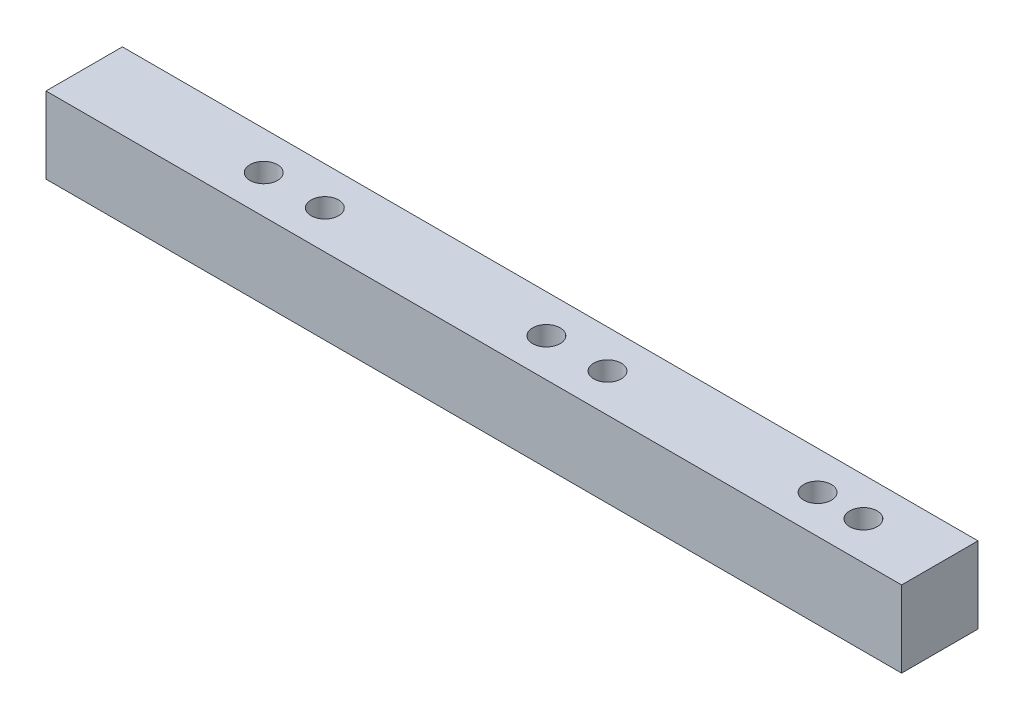
ISO-10303-21;
HEADER;
FILE_DESCRIPTION(('STEP AP214'),'2;1');
FILE_NAME('part.step','',(''),(''),'','','');
FILE_SCHEMA(('AUTOMOTIVE_DESIGN { 1 0 10303 214 1 1 1 1 }'));
ENDSEC;
DATA;
#1=APPLICATION_CONTEXT('core data for automotive mechanical design processes');
#2=APPLICATION_PROTOCOL_DEFINITION('international standard','automotive_design',2000,#1);
#3=PRODUCT_CONTEXT('',#1,'mechanical');
#4=PRODUCT('Part','Part','',(#3));
#5=PRODUCT_RELATED_PRODUCT_CATEGORY('part','',(#4));
#6=PRODUCT_DEFINITION_FORMATION('','',#4);
#7=PRODUCT_DEFINITION_CONTEXT('part definition',#1,'design');
#8=PRODUCT_DEFINITION('design','',#6,#7);
#9=PRODUCT_DEFINITION_SHAPE('','',#8);
#10=(LENGTH_UNIT() NAMED_UNIT(*) SI_UNIT(.MILLI.,.METRE.));
#11=(NAMED_UNIT(*) PLANE_ANGLE_UNIT() SI_UNIT($,.RADIAN.));
#12=(NAMED_UNIT(*) SI_UNIT($,.STERADIAN.) SOLID_ANGLE_UNIT());
#13=UNCERTAINTY_MEASURE_WITH_UNIT(LENGTH_MEASURE(1.E-05),#10,'distance_accuracy_value','');
#14=(GEOMETRIC_REPRESENTATION_CONTEXT(3) GLOBAL_UNCERTAINTY_ASSIGNED_CONTEXT((#13)) GLOBAL_UNIT_ASSIGNED_CONTEXT((#10,
#11,#12)) REPRESENTATION_CONTEXT('',''));
#15=CARTESIAN_POINT('',(0.,0.,0.));
#16=DIRECTION('',(0.,0.,1.));
#17=DIRECTION('',(1.,0.,0.));
#18=AXIS2_PLACEMENT_3D('',#15,#16,#17);
#19=CARTESIAN_POINT('',(-35.56,0.,6.35));
#20=DIRECTION('',(1.,0.,0.));
#21=DIRECTION('',(0.,0.,-1.));
#22=AXIS2_PLACEMENT_3D('',#19,#20,#21);
#23=PLANE('',#22);
#24=DIRECTION('',(0.,-1.,0.));
#25=VECTOR('',#24,1.);
#26=CARTESIAN_POINT('',(-35.56,0.,0.));
#27=LINE('',#26,#25);
#28=CARTESIAN_POINT('',(-35.56,6.35,0.));
#29=VERTEX_POINT('',#28);
#30=CARTESIAN_POINT('',(-35.56,0.,0.));
#31=VERTEX_POINT('',#30);
#32=EDGE_CURVE('E107',#29,#31,#27,.T.);
#33=ORIENTED_EDGE('',*,*,#32,.T.);
#34=DIRECTION('',(0.,0.,-1.));
#35=VECTOR('',#34,1.);
#36=CARTESIAN_POINT('',(-35.56,0.,6.35));
#37=LINE('',#36,#35);
#38=CARTESIAN_POINT('',(-35.56,0.,6.35));
#39=VERTEX_POINT('',#38);
#40=EDGE_CURVE('E11',#39,#31,#37,.T.);
#41=ORIENTED_EDGE('',*,*,#40,.F.);
#42=DIRECTION('',(0.,-1.,0.));
#43=VECTOR('',#42,1.);
#44=CARTESIAN_POINT('',(-35.56,0.,6.35));
#45=LINE('',#44,#43);
#46=CARTESIAN_POINT('',(-35.56,6.35,6.35));
#47=VERTEX_POINT('',#46);
#48=EDGE_CURVE('E91',#47,#39,#45,.T.);
#49=ORIENTED_EDGE('',*,*,#48,.F.);
#50=DIRECTION('',(0.,0.,-1.));
#51=VECTOR('',#50,1.);
#52=CARTESIAN_POINT('',(-35.56,6.35,6.35));
#53=LINE('',#52,#51);
#54=EDGE_CURVE('E103',#47,#29,#53,.T.);
#55=ORIENTED_EDGE('',*,*,#54,.T.);
#56=EDGE_LOOP('',(#33,#41,#49,#55));
#57=FACE_BOUND('',#56,.T.);
#58=ADVANCED_FACE('F39',(#57),#23,.F.);
#59=CARTESIAN_POINT('',(-35.56,0.,6.35));
#60=DIRECTION('',(0.,1.,0.));
#61=DIRECTION('',(0.,0.,1.));
#62=AXIS2_PLACEMENT_3D('',#59,#60,#61);
#63=PLANE('',#62);
#64=CARTESIAN_POINT('',(-20.6375,0.,3.175));
#65=DIRECTION('',(0.,1.,0.));
#66=DIRECTION('',(0.,0.,1.));
#67=AXIS2_PLACEMENT_3D('',#64,#65,#66);
#68=CIRCLE('',#67,1.143);
#69=CARTESIAN_POINT('',(-20.6375,0.,4.318));
#70=VERTEX_POINT('',#69);
#71=EDGE_CURVE('E168',#70,#70,#68,.T.);
#72=ORIENTED_EDGE('',*,*,#71,.T.);
#73=EDGE_LOOP('',(#72));
#74=FACE_BOUND('',#73,.T.);
#75=CARTESIAN_POINT('',(-15.5575,0.,3.175));
#76=DIRECTION('',(0.,1.,0.));
#77=DIRECTION('',(0.,0.,1.));
#78=AXIS2_PLACEMENT_3D('',#75,#76,#77);
#79=CIRCLE('',#78,1.143);
#80=CARTESIAN_POINT('',(-15.5575,0.,4.318));
#81=VERTEX_POINT('',#80);
#82=EDGE_CURVE('E160',#81,#81,#79,.T.);
#83=ORIENTED_EDGE('',*,*,#82,.T.);
#84=EDGE_LOOP('',(#83));
#85=FACE_BOUND('',#84,.T.);
#86=CARTESIAN_POINT('',(2.8575,0.,3.175));
#87=DIRECTION('',(0.,1.,0.));
#88=DIRECTION('',(0.,0.,1.));
#89=AXIS2_PLACEMENT_3D('',#86,#87,#88);
#90=CIRCLE('',#89,1.143);
#91=CARTESIAN_POINT('',(2.8575,0.,4.318));
#92=VERTEX_POINT('',#91);
#93=EDGE_CURVE('E152',#92,#92,#90,.T.);
#94=ORIENTED_EDGE('',*,*,#93,.T.);
#95=EDGE_LOOP('',(#94));
#96=FACE_BOUND('',#95,.T.);
#97=CARTESIAN_POINT('',(7.9375,0.,3.175));
#98=DIRECTION('',(0.,1.,0.));
#99=DIRECTION('',(0.,0.,1.));
#100=AXIS2_PLACEMENT_3D('',#97,#98,#99);
#101=CIRCLE('',#100,1.143);
#102=CARTESIAN_POINT('',(7.9375,0.,4.318));
#103=VERTEX_POINT('',#102);
#104=EDGE_CURVE('E144',#103,#103,#101,.T.);
#105=ORIENTED_EDGE('',*,*,#104,.T.);
#106=EDGE_LOOP('',(#105));
#107=FACE_BOUND('',#106,.T.);
#108=CARTESIAN_POINT('',(25.4,0.,3.175));
#109=DIRECTION('',(0.,1.,0.));
#110=DIRECTION('',(0.,0.,1.));
#111=AXIS2_PLACEMENT_3D('',#108,#109,#110);
#112=CIRCLE('',#111,1.143);
#113=CARTESIAN_POINT('',(25.4,0.,4.318));
#114=VERTEX_POINT('',#113);
#115=EDGE_CURVE('E136',#114,#114,#112,.T.);
#116=ORIENTED_EDGE('',*,*,#115,.T.);
#117=EDGE_LOOP('',(#116));
#118=FACE_BOUND('',#117,.T.);
#119=CARTESIAN_POINT('',(29.21,0.,3.175));
#120=DIRECTION('',(0.,1.,0.));
#121=DIRECTION('',(0.,0.,1.));
#122=AXIS2_PLACEMENT_3D('',#119,#120,#121);
#123=CIRCLE('',#122,1.143);
#124=CARTESIAN_POINT('',(29.21,0.,4.318));
#125=VERTEX_POINT('',#124);
#126=EDGE_CURVE('E128',#125,#125,#123,.T.);
#127=ORIENTED_EDGE('',*,*,#126,.T.);
#128=EDGE_LOOP('',(#127));
#129=FACE_BOUND('',#128,.T.);
#130=DIRECTION('',(1.,0.,0.));
#131=VECTOR('',#130,1.);
#132=CARTESIAN_POINT('',(-35.56,0.,0.));
#133=LINE('',#132,#131);
#134=CARTESIAN_POINT('',(35.56,0.,0.));
#135=VERTEX_POINT('',#134);
#136=EDGE_CURVE('E96',#31,#135,#133,.T.);
#137=ORIENTED_EDGE('',*,*,#136,.T.);
#138=DIRECTION('',(0.,0.,-1.));
#139=VECTOR('',#138,1.);
#140=CARTESIAN_POINT('',(35.56,0.,6.35));
#141=LINE('',#140,#139);
#142=CARTESIAN_POINT('',(35.56,0.,6.35));
#143=VERTEX_POINT('',#142);
#144=EDGE_CURVE('E48',#143,#135,#141,.T.);
#145=ORIENTED_EDGE('',*,*,#144,.F.);
#146=DIRECTION('',(1.,0.,0.));
#147=VECTOR('',#146,1.);
#148=CARTESIAN_POINT('',(-35.56,0.,6.35));
#149=LINE('',#148,#147);
#150=EDGE_CURVE('E86',#39,#143,#149,.T.);
#151=ORIENTED_EDGE('',*,*,#150,.F.);
#152=ORIENTED_EDGE('',*,*,#40,.T.);
#153=EDGE_LOOP('',(#137,#145,#151,#152));
#154=FACE_BOUND('',#153,.T.);
#155=ADVANCED_FACE('F95',(#74,#85,#96,#107,#118,#129,#154),#63,.F.);
#156=CARTESIAN_POINT('',(35.56,0.,6.35));
#157=DIRECTION('',(-1.,0.,0.));
#158=DIRECTION('',(0.,0.,1.));
#159=AXIS2_PLACEMENT_3D('',#156,#157,#158);
#160=PLANE('',#159);
#161=DIRECTION('',(0.,1.,0.));
#162=VECTOR('',#161,1.);
#163=CARTESIAN_POINT('',(35.56,0.,0.));
#164=LINE('',#163,#162);
#165=CARTESIAN_POINT('',(35.56,6.35,0.));
#166=VERTEX_POINT('',#165);
#167=EDGE_CURVE('E73',#135,#166,#164,.T.);
#168=ORIENTED_EDGE('',*,*,#167,.T.);
#169=DIRECTION('',(0.,0.,-1.));
#170=VECTOR('',#169,1.);
#171=CARTESIAN_POINT('',(35.56,6.35,6.35));
#172=LINE('',#171,#170);
#173=CARTESIAN_POINT('',(35.56,6.35,6.35));
#174=VERTEX_POINT('',#173);
#175=EDGE_CURVE('E98',#174,#166,#172,.T.);
#176=ORIENTED_EDGE('',*,*,#175,.F.);
#177=DIRECTION('',(0.,1.,0.));
#178=VECTOR('',#177,1.);
#179=CARTESIAN_POINT('',(35.56,0.,6.35));
#180=LINE('',#179,#178);
#181=EDGE_CURVE('E89',#143,#174,#180,.T.);
#182=ORIENTED_EDGE('',*,*,#181,.F.);
#183=ORIENTED_EDGE('',*,*,#144,.T.);
#184=EDGE_LOOP('',(#168,#176,#182,#183));
#185=FACE_BOUND('',#184,.T.);
#186=ADVANCED_FACE('F99',(#185),#160,.F.);
#187=CARTESIAN_POINT('',(-35.56,6.35,6.35));
#188=DIRECTION('',(0.,-1.,0.));
#189=DIRECTION('',(0.,0.,-1.));
#190=AXIS2_PLACEMENT_3D('',#187,#188,#189);
#191=PLANE('',#190);
#192=CARTESIAN_POINT('',(-20.6375,6.35,3.175));
#193=DIRECTION('',(0.,1.,0.));
#194=DIRECTION('',(0.,0.,1.));
#195=AXIS2_PLACEMENT_3D('',#192,#193,#194);
#196=CIRCLE('',#195,1.143);
#197=CARTESIAN_POINT('',(-20.6375,6.35,4.318));
#198=VERTEX_POINT('',#197);
#199=EDGE_CURVE('E111',#198,#198,#196,.T.);
#200=ORIENTED_EDGE('',*,*,#199,.F.);
#201=EDGE_LOOP('',(#200));
#202=FACE_BOUND('',#201,.T.);
#203=CARTESIAN_POINT('',(-15.5575,6.35,3.175));
#204=DIRECTION('',(0.,1.,0.));
#205=DIRECTION('',(0.,0.,1.));
#206=AXIS2_PLACEMENT_3D('',#203,#204,#205);
#207=CIRCLE('',#206,1.143);
#208=CARTESIAN_POINT('',(-15.5575,6.35,4.318));
#209=VERTEX_POINT('',#208);
#210=EDGE_CURVE('E164',#209,#209,#207,.T.);
#211=ORIENTED_EDGE('',*,*,#210,.F.);
#212=EDGE_LOOP('',(#211));
#213=FACE_BOUND('',#212,.T.);
#214=CARTESIAN_POINT('',(2.8575,6.35,3.175));
#215=DIRECTION('',(0.,1.,0.));
#216=DIRECTION('',(0.,0.,1.));
#217=AXIS2_PLACEMENT_3D('',#214,#215,#216);
#218=CIRCLE('',#217,1.143);
#219=CARTESIAN_POINT('',(2.8575,6.35,4.318));
#220=VERTEX_POINT('',#219);
#221=EDGE_CURVE('E156',#220,#220,#218,.T.);
#222=ORIENTED_EDGE('',*,*,#221,.F.);
#223=EDGE_LOOP('',(#222));
#224=FACE_BOUND('',#223,.T.);
#225=CARTESIAN_POINT('',(7.9375,6.35,3.175));
#226=DIRECTION('',(0.,1.,0.));
#227=DIRECTION('',(0.,0.,1.));
#228=AXIS2_PLACEMENT_3D('',#225,#226,#227);
#229=CIRCLE('',#228,1.143);
#230=CARTESIAN_POINT('',(7.9375,6.35,4.318));
#231=VERTEX_POINT('',#230);
#232=EDGE_CURVE('E148',#231,#231,#229,.T.);
#233=ORIENTED_EDGE('',*,*,#232,.F.);
#234=EDGE_LOOP('',(#233));
#235=FACE_BOUND('',#234,.T.);
#236=CARTESIAN_POINT('',(25.4,6.35,3.175));
#237=DIRECTION('',(0.,1.,0.));
#238=DIRECTION('',(0.,0.,1.));
#239=AXIS2_PLACEMENT_3D('',#236,#237,#238);
#240=CIRCLE('',#239,1.143);
#241=CARTESIAN_POINT('',(25.4,6.35,4.318));
#242=VERTEX_POINT('',#241);
#243=EDGE_CURVE('E140',#242,#242,#240,.T.);
#244=ORIENTED_EDGE('',*,*,#243,.F.);
#245=EDGE_LOOP('',(#244));
#246=FACE_BOUND('',#245,.T.);
#247=CARTESIAN_POINT('',(29.21,6.35,3.175));
#248=DIRECTION('',(0.,1.,0.));
#249=DIRECTION('',(0.,0.,1.));
#250=AXIS2_PLACEMENT_3D('',#247,#248,#249);
#251=CIRCLE('',#250,1.143);
#252=CARTESIAN_POINT('',(29.21,6.35,4.318));
#253=VERTEX_POINT('',#252);
#254=EDGE_CURVE('E132',#253,#253,#251,.T.);
#255=ORIENTED_EDGE('',*,*,#254,.F.);
#256=EDGE_LOOP('',(#255));
#257=FACE_BOUND('',#256,.T.);
#258=DIRECTION('',(-1.,0.,0.));
#259=VECTOR('',#258,1.);
#260=CARTESIAN_POINT('',(-35.56,6.35,0.));
#261=LINE('',#260,#259);
#262=EDGE_CURVE('E79',#166,#29,#261,.T.);
#263=ORIENTED_EDGE('',*,*,#262,.T.);
#264=ORIENTED_EDGE('',*,*,#54,.F.);
#265=DIRECTION('',(-1.,0.,0.));
#266=VECTOR('',#265,1.);
#267=CARTESIAN_POINT('',(-35.56,6.35,6.35));
#268=LINE('',#267,#266);
#269=EDGE_CURVE('E56',#174,#47,#268,.T.);
#270=ORIENTED_EDGE('',*,*,#269,.F.);
#271=ORIENTED_EDGE('',*,*,#175,.T.);
#272=EDGE_LOOP('',(#263,#264,#270,#271));
#273=FACE_BOUND('',#272,.T.);
#274=ADVANCED_FACE('F121',(#202,#213,#224,#235,#246,#257,#273),#191,.F.);
#275=CARTESIAN_POINT('',(0.,0.,6.35));
#276=DIRECTION('',(0.,0.,-1.));
#277=DIRECTION('',(-1.,0.,0.));
#278=AXIS2_PLACEMENT_3D('',#275,#276,#277);
#279=PLANE('',#278);
#280=ORIENTED_EDGE('',*,*,#48,.T.);
#281=ORIENTED_EDGE('',*,*,#150,.T.);
#282=ORIENTED_EDGE('',*,*,#181,.T.);
#283=ORIENTED_EDGE('',*,*,#269,.T.);
#284=EDGE_LOOP('',(#280,#281,#282,#283));
#285=FACE_BOUND('',#284,.T.);
#286=ADVANCED_FACE('F87',(#285),#279,.F.);
#287=CARTESIAN_POINT('',(0.,0.,0.));
#288=DIRECTION('',(0.,0.,-1.));
#289=DIRECTION('',(-1.,0.,0.));
#290=AXIS2_PLACEMENT_3D('',#287,#288,#289);
#291=PLANE('',#290);
#292=ORIENTED_EDGE('',*,*,#32,.F.);
#293=ORIENTED_EDGE('',*,*,#262,.F.);
#294=ORIENTED_EDGE('',*,*,#167,.F.);
#295=ORIENTED_EDGE('',*,*,#136,.F.);
#296=EDGE_LOOP('',(#292,#293,#294,#295));
#297=FACE_BOUND('',#296,.T.);
#298=ADVANCED_FACE('F124',(#297),#291,.T.);
#299=CARTESIAN_POINT('',(29.21,6.35,3.175));
#300=DIRECTION('',(0.,-1.,0.));
#301=DIRECTION('',(0.,0.,-1.));
#302=AXIS2_PLACEMENT_3D('',#299,#300,#301);
#303=CYLINDRICAL_SURFACE('',#302,1.143);
#304=ORIENTED_EDGE('',*,*,#254,.T.);
#305=EDGE_LOOP('',(#304));
#306=FACE_BOUND('',#305,.T.);
#307=ORIENTED_EDGE('',*,*,#126,.F.);
#308=EDGE_LOOP('',(#307));
#309=FACE_BOUND('',#308,.T.);
#310=ADVANCED_FACE('F192',(#306,#309),#303,.F.);
#311=CARTESIAN_POINT('',(25.4,6.35,3.175));
#312=DIRECTION('',(0.,-1.,0.));
#313=DIRECTION('',(0.,0.,-1.));
#314=AXIS2_PLACEMENT_3D('',#311,#312,#313);
#315=CYLINDRICAL_SURFACE('',#314,1.143);
#316=ORIENTED_EDGE('',*,*,#243,.T.);
#317=EDGE_LOOP('',(#316));
#318=FACE_BOUND('',#317,.T.);
#319=ORIENTED_EDGE('',*,*,#115,.F.);
#320=EDGE_LOOP('',(#319));
#321=FACE_BOUND('',#320,.T.);
#322=ADVANCED_FACE('F195',(#318,#321),#315,.F.);
#323=CARTESIAN_POINT('',(7.9375,6.35,3.175));
#324=DIRECTION('',(0.,-1.,0.));
#325=DIRECTION('',(0.,0.,-1.));
#326=AXIS2_PLACEMENT_3D('',#323,#324,#325);
#327=CYLINDRICAL_SURFACE('',#326,1.143);
#328=ORIENTED_EDGE('',*,*,#232,.T.);
#329=EDGE_LOOP('',(#328));
#330=FACE_BOUND('',#329,.T.);
#331=ORIENTED_EDGE('',*,*,#104,.F.);
#332=EDGE_LOOP('',(#331));
#333=FACE_BOUND('',#332,.T.);
#334=ADVANCED_FACE('F214',(#330,#333),#327,.F.);
#335=CARTESIAN_POINT('',(2.8575,6.35,3.175));
#336=DIRECTION('',(0.,-1.,0.));
#337=DIRECTION('',(0.,0.,-1.));
#338=AXIS2_PLACEMENT_3D('',#335,#336,#337);
#339=CYLINDRICAL_SURFACE('',#338,1.143);
#340=ORIENTED_EDGE('',*,*,#221,.T.);
#341=EDGE_LOOP('',(#340));
#342=FACE_BOUND('',#341,.T.);
#343=ORIENTED_EDGE('',*,*,#93,.F.);
#344=EDGE_LOOP('',(#343));
#345=FACE_BOUND('',#344,.T.);
#346=ADVANCED_FACE('F218',(#342,#345),#339,.F.);
#347=CARTESIAN_POINT('',(-15.5575,6.35,3.175));
#348=DIRECTION('',(0.,-1.,0.));
#349=DIRECTION('',(0.,0.,-1.));
#350=AXIS2_PLACEMENT_3D('',#347,#348,#349);
#351=CYLINDRICAL_SURFACE('',#350,1.143);
#352=ORIENTED_EDGE('',*,*,#210,.T.);
#353=EDGE_LOOP('',(#352));
#354=FACE_BOUND('',#353,.T.);
#355=ORIENTED_EDGE('',*,*,#82,.F.);
#356=EDGE_LOOP('',(#355));
#357=FACE_BOUND('',#356,.T.);
#358=ADVANCED_FACE('F222',(#354,#357),#351,.F.);
#359=CARTESIAN_POINT('',(-20.6375,6.35,3.175));
#360=DIRECTION('',(0.,-1.,0.));
#361=DIRECTION('',(0.,0.,-1.));
#362=AXIS2_PLACEMENT_3D('',#359,#360,#361);
#363=CYLINDRICAL_SURFACE('',#362,1.143);
#364=ORIENTED_EDGE('',*,*,#199,.T.);
#365=EDGE_LOOP('',(#364));
#366=FACE_BOUND('',#365,.T.);
#367=ORIENTED_EDGE('',*,*,#71,.F.);
#368=EDGE_LOOP('',(#367));
#369=FACE_BOUND('',#368,.T.);
#370=ADVANCED_FACE('F176',(#366,#369),#363,.F.);
#371=CLOSED_SHELL('',(#58,#155,#186,#274,#286,#298,#310,#322,#334,#346,#358,#370));
#372=MANIFOLD_SOLID_BREP('B2',#371);
#373=ADVANCED_BREP_SHAPE_REPRESENTATION('',(#18,#372),#14);
#374=SHAPE_DEFINITION_REPRESENTATION(#9,#373);
ENDSEC;
END-ISO-10303-21;
